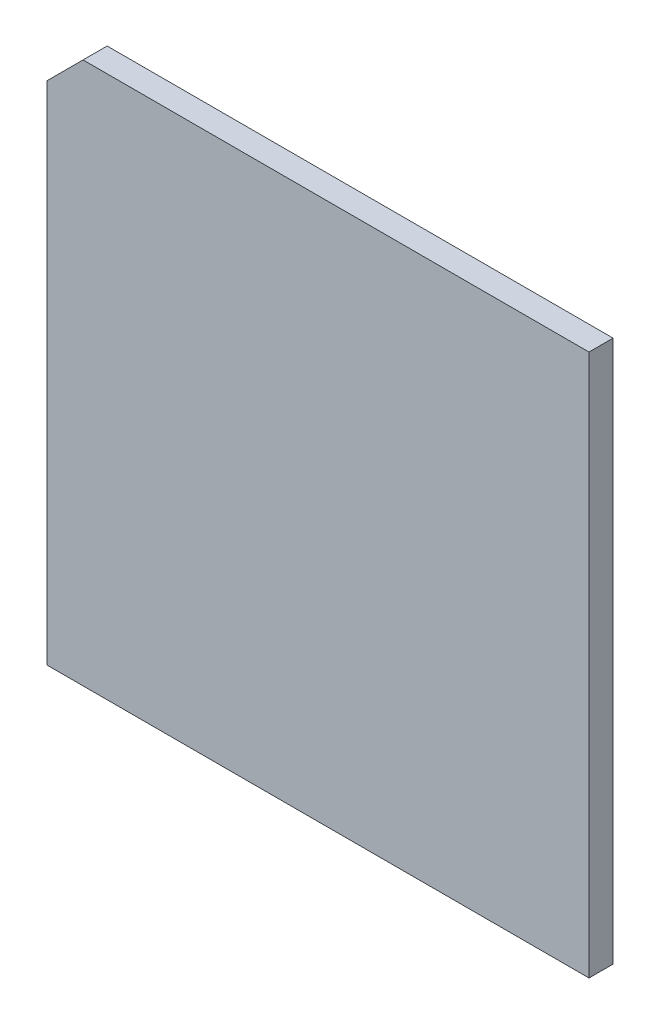
ISO-10303-21;
HEADER;
FILE_DESCRIPTION(('STEP AP214'),'2;1');
FILE_NAME('part.step','',(''),(''),'','','');
FILE_SCHEMA(('AUTOMOTIVE_DESIGN { 1 0 10303 214 1 1 1 1 }'));
ENDSEC;
DATA;
#1=APPLICATION_CONTEXT('core data for automotive mechanical design processes');
#2=APPLICATION_PROTOCOL_DEFINITION('international standard','automotive_design',2000,#1);
#3=PRODUCT_CONTEXT('',#1,'mechanical');
#4=PRODUCT('Part','Part','',(#3));
#5=PRODUCT_RELATED_PRODUCT_CATEGORY('part','',(#4));
#6=PRODUCT_DEFINITION_FORMATION('','',#4);
#7=PRODUCT_DEFINITION_CONTEXT('part definition',#1,'design');
#8=PRODUCT_DEFINITION('design','',#6,#7);
#9=PRODUCT_DEFINITION_SHAPE('','',#8);
#10=(LENGTH_UNIT() NAMED_UNIT(*) SI_UNIT(.MILLI.,.METRE.));
#11=(NAMED_UNIT(*) PLANE_ANGLE_UNIT() SI_UNIT($,.RADIAN.));
#12=(NAMED_UNIT(*) SI_UNIT($,.STERADIAN.) SOLID_ANGLE_UNIT());
#13=UNCERTAINTY_MEASURE_WITH_UNIT(LENGTH_MEASURE(1.E-05),#10,'distance_accuracy_value','');
#14=(GEOMETRIC_REPRESENTATION_CONTEXT(3) GLOBAL_UNCERTAINTY_ASSIGNED_CONTEXT((#13)) GLOBAL_UNIT_ASSIGNED_CONTEXT((#10,
#11,#12)) REPRESENTATION_CONTEXT('',''));
#15=CARTESIAN_POINT('',(0.,0.,0.));
#16=DIRECTION('',(0.,0.,1.));
#17=DIRECTION('',(1.,0.,0.));
#18=AXIS2_PLACEMENT_3D('',#15,#16,#17);
#19=CARTESIAN_POINT('',(0.023229315617678,-0.0232293156176783,0.2));
#20=DIRECTION('',(0.,0.,1.));
#21=DIRECTION('',(1.,0.,0.));
#22=AXIS2_PLACEMENT_3D('',#19,#20,#21);
#23=PLANE('',#22);
#24=DIRECTION('',(-0.707106781186547,-0.707106781186548,0.));
#25=VECTOR('',#24,1.);
#26=CARTESIAN_POINT('',(-1.95,2.25,0.2));
#27=LINE('',#26,#25);
#28=CARTESIAN_POINT('',(-1.95,2.25,0.2));
#29=VERTEX_POINT('',#28);
#30=CARTESIAN_POINT('',(-2.25,1.95,0.2));
#31=VERTEX_POINT('',#30);
#32=EDGE_CURVE('E11',#29,#31,#27,.T.);
#33=ORIENTED_EDGE('',*,*,#32,.T.);
#34=DIRECTION('',(0.,-1.,0.));
#35=VECTOR('',#34,1.);
#36=CARTESIAN_POINT('',(-2.25,1.95,0.2));
#37=LINE('',#36,#35);
#38=CARTESIAN_POINT('',(-2.25,-2.25,0.2));
#39=VERTEX_POINT('',#38);
#40=EDGE_CURVE('E24',#31,#39,#37,.T.);
#41=ORIENTED_EDGE('',*,*,#40,.T.);
#42=DIRECTION('',(1.,0.,0.));
#43=VECTOR('',#42,1.);
#44=CARTESIAN_POINT('',(-2.25,-2.25,0.2));
#45=LINE('',#44,#43);
#46=CARTESIAN_POINT('',(2.25,-2.25,0.2));
#47=VERTEX_POINT('',#46);
#48=EDGE_CURVE('E101',#39,#47,#45,.T.);
#49=ORIENTED_EDGE('',*,*,#48,.T.);
#50=DIRECTION('',(0.,1.,0.));
#51=VECTOR('',#50,1.);
#52=CARTESIAN_POINT('',(2.25,-2.25,0.2));
#53=LINE('',#52,#51);
#54=CARTESIAN_POINT('',(2.25,2.25,0.2));
#55=VERTEX_POINT('',#54);
#56=EDGE_CURVE('E77',#47,#55,#53,.T.);
#57=ORIENTED_EDGE('',*,*,#56,.T.);
#58=DIRECTION('',(-1.,0.,0.));
#59=VECTOR('',#58,1.);
#60=CARTESIAN_POINT('',(2.25,2.25,0.2));
#61=LINE('',#60,#59);
#62=EDGE_CURVE('E98',#55,#29,#61,.T.);
#63=ORIENTED_EDGE('',*,*,#62,.T.);
#64=EDGE_LOOP('',(#33,#41,#49,#57,#63));
#65=FACE_BOUND('',#64,.T.);
#66=ADVANCED_FACE('F17',(#65),#23,.T.);
#67=CARTESIAN_POINT('',(-2.1,2.1,0.));
#68=DIRECTION('',(-0.707106781186548,0.707106781186548,0.));
#69=DIRECTION('',(0.,0.,1.));
#70=AXIS2_PLACEMENT_3D('',#67,#68,#69);
#71=PLANE('',#70);
#72=DIRECTION('',(-0.707106781186548,-0.707106781186548,0.));
#73=VECTOR('',#72,1.);
#74=CARTESIAN_POINT('',(-2.1,2.1,0.));
#75=LINE('',#74,#73);
#76=CARTESIAN_POINT('',(-1.95,2.25,0.));
#77=VERTEX_POINT('',#76);
#78=CARTESIAN_POINT('',(-2.25,1.95,0.));
#79=VERTEX_POINT('',#78);
#80=EDGE_CURVE('E96',#77,#79,#75,.T.);
#81=ORIENTED_EDGE('',*,*,#80,.T.);
#82=DIRECTION('',(0.,0.,1.));
#83=VECTOR('',#82,1.);
#84=CARTESIAN_POINT('',(-2.25,1.95,0.));
#85=LINE('',#84,#83);
#86=EDGE_CURVE('E94',#79,#31,#85,.T.);
#87=ORIENTED_EDGE('',*,*,#86,.T.);
#88=ORIENTED_EDGE('',*,*,#32,.F.);
#89=DIRECTION('',(0.,0.,-1.));
#90=VECTOR('',#89,1.);
#91=CARTESIAN_POINT('',(-1.95,2.25,0.));
#92=LINE('',#91,#90);
#93=EDGE_CURVE('E92',#29,#77,#92,.T.);
#94=ORIENTED_EDGE('',*,*,#93,.T.);
#95=EDGE_LOOP('',(#81,#87,#88,#94));
#96=FACE_BOUND('',#95,.T.);
#97=ADVANCED_FACE('F106',(#96),#71,.T.);
#98=CARTESIAN_POINT('',(2.25,2.25,0.));
#99=DIRECTION('',(0.,1.,0.));
#100=DIRECTION('',(-1.,0.,0.));
#101=AXIS2_PLACEMENT_3D('',#98,#99,#100);
#102=PLANE('',#101);
#103=ORIENTED_EDGE('',*,*,#93,.F.);
#104=ORIENTED_EDGE('',*,*,#62,.F.);
#105=DIRECTION('',(0.,0.,1.));
#106=VECTOR('',#105,1.);
#107=CARTESIAN_POINT('',(2.25,2.25,0.));
#108=LINE('',#107,#106);
#109=CARTESIAN_POINT('',(2.25,2.25,0.));
#110=VERTEX_POINT('',#109);
#111=EDGE_CURVE('E90',#110,#55,#108,.T.);
#112=ORIENTED_EDGE('',*,*,#111,.F.);
#113=DIRECTION('',(-1.,0.,0.));
#114=VECTOR('',#113,1.);
#115=CARTESIAN_POINT('',(2.25,2.25,0.));
#116=LINE('',#115,#114);
#117=EDGE_CURVE('E68',#110,#77,#116,.T.);
#118=ORIENTED_EDGE('',*,*,#117,.T.);
#119=EDGE_LOOP('',(#103,#104,#112,#118));
#120=FACE_BOUND('',#119,.T.);
#121=ADVANCED_FACE('F109',(#120),#102,.T.);
#122=CARTESIAN_POINT('',(-2.25,2.25,0.));
#123=DIRECTION('',(-1.,0.,0.));
#124=DIRECTION('',(0.,-1.,0.));
#125=AXIS2_PLACEMENT_3D('',#122,#123,#124);
#126=PLANE('',#125);
#127=ORIENTED_EDGE('',*,*,#86,.F.);
#128=DIRECTION('',(0.,-1.,0.));
#129=VECTOR('',#128,1.);
#130=CARTESIAN_POINT('',(-2.25,2.25,0.));
#131=LINE('',#130,#129);
#132=CARTESIAN_POINT('',(-2.25,-2.25,0.));
#133=VERTEX_POINT('',#132);
#134=EDGE_CURVE('E87',#79,#133,#131,.T.);
#135=ORIENTED_EDGE('',*,*,#134,.T.);
#136=DIRECTION('',(0.,0.,1.));
#137=VECTOR('',#136,1.);
#138=CARTESIAN_POINT('',(-2.25,-2.25,0.));
#139=LINE('',#138,#137);
#140=EDGE_CURVE('E71',#133,#39,#139,.T.);
#141=ORIENTED_EDGE('',*,*,#140,.T.);
#142=ORIENTED_EDGE('',*,*,#40,.F.);
#143=EDGE_LOOP('',(#127,#135,#141,#142));
#144=FACE_BOUND('',#143,.T.);
#145=ADVANCED_FACE('F104',(#144),#126,.T.);
#146=CARTESIAN_POINT('',(2.25,-2.25,0.));
#147=DIRECTION('',(1.,0.,0.));
#148=DIRECTION('',(0.,1.,0.));
#149=AXIS2_PLACEMENT_3D('',#146,#147,#148);
#150=PLANE('',#149);
#151=DIRECTION('',(0.,1.,0.));
#152=VECTOR('',#151,1.);
#153=CARTESIAN_POINT('',(2.25,-2.25,0.));
#154=LINE('',#153,#152);
#155=CARTESIAN_POINT('',(2.25,-2.25,0.));
#156=VERTEX_POINT('',#155);
#157=EDGE_CURVE('E61',#156,#110,#154,.T.);
#158=ORIENTED_EDGE('',*,*,#157,.T.);
#159=ORIENTED_EDGE('',*,*,#111,.T.);
#160=ORIENTED_EDGE('',*,*,#56,.F.);
#161=DIRECTION('',(0.,0.,1.));
#162=VECTOR('',#161,1.);
#163=CARTESIAN_POINT('',(2.25,-2.25,0.));
#164=LINE('',#163,#162);
#165=EDGE_CURVE('E72',#156,#47,#164,.T.);
#166=ORIENTED_EDGE('',*,*,#165,.F.);
#167=EDGE_LOOP('',(#158,#159,#160,#166));
#168=FACE_BOUND('',#167,.T.);
#169=ADVANCED_FACE('F76',(#168),#150,.T.);
#170=CARTESIAN_POINT('',(-2.25,-2.25,0.));
#171=DIRECTION('',(0.,-1.,0.));
#172=DIRECTION('',(1.,0.,0.));
#173=AXIS2_PLACEMENT_3D('',#170,#171,#172);
#174=PLANE('',#173);
#175=DIRECTION('',(1.,0.,0.));
#176=VECTOR('',#175,1.);
#177=CARTESIAN_POINT('',(-2.25,-2.25,0.));
#178=LINE('',#177,#176);
#179=EDGE_CURVE('E66',#133,#156,#178,.T.);
#180=ORIENTED_EDGE('',*,*,#179,.T.);
#181=ORIENTED_EDGE('',*,*,#165,.T.);
#182=ORIENTED_EDGE('',*,*,#48,.F.);
#183=ORIENTED_EDGE('',*,*,#140,.F.);
#184=EDGE_LOOP('',(#180,#181,#182,#183));
#185=FACE_BOUND('',#184,.T.);
#186=ADVANCED_FACE('F82',(#185),#174,.T.);
#187=CARTESIAN_POINT('',(0.,0.,0.));
#188=DIRECTION('',(0.,0.,1.));
#189=DIRECTION('',(1.,0.,0.));
#190=AXIS2_PLACEMENT_3D('',#187,#188,#189);
#191=PLANE('',#190);
#192=ORIENTED_EDGE('',*,*,#80,.F.);
#193=ORIENTED_EDGE('',*,*,#117,.F.);
#194=ORIENTED_EDGE('',*,*,#157,.F.);
#195=ORIENTED_EDGE('',*,*,#179,.F.);
#196=ORIENTED_EDGE('',*,*,#134,.F.);
#197=EDGE_LOOP('',(#192,#193,#194,#195,#196));
#198=FACE_BOUND('',#197,.T.);
#199=ADVANCED_FACE('F63',(#198),#191,.F.);
#200=CLOSED_SHELL('',(#66,#97,#121,#145,#169,#186,#199));
#201=MANIFOLD_SOLID_BREP('B1',#200);
#202=ADVANCED_BREP_SHAPE_REPRESENTATION('',(#18,#201),#14);
#203=SHAPE_DEFINITION_REPRESENTATION(#9,#202);
ENDSEC;
END-ISO-10303-21;
